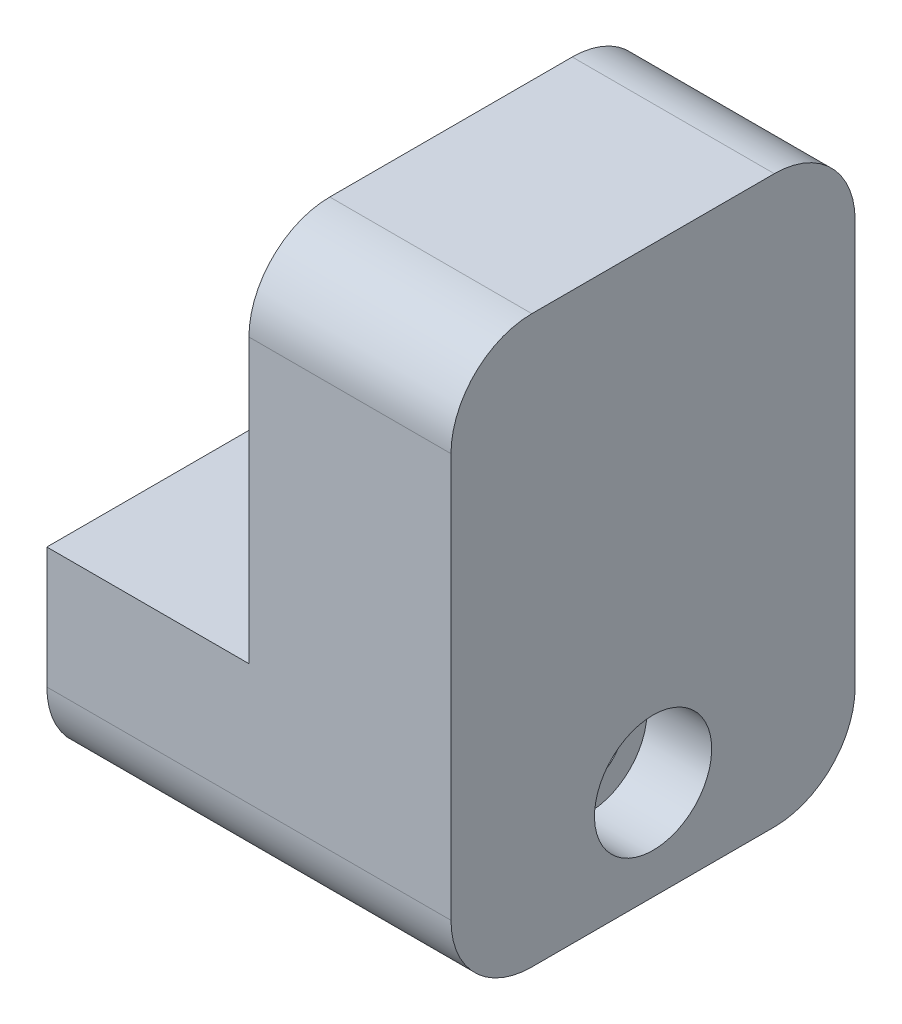
ISO-10303-21;
HEADER;
FILE_DESCRIPTION(('STEP AP214'),'2;1');
FILE_NAME('part.step','',(''),(''),'','','');
FILE_SCHEMA(('AUTOMOTIVE_DESIGN { 1 0 10303 214 1 1 1 1 }'));
ENDSEC;
DATA;
#1=APPLICATION_CONTEXT('core data for automotive mechanical design processes');
#2=APPLICATION_PROTOCOL_DEFINITION('international standard','automotive_design',2000,#1);
#3=PRODUCT_CONTEXT('',#1,'mechanical');
#4=PRODUCT('Part','Part','',(#3));
#5=PRODUCT_RELATED_PRODUCT_CATEGORY('part','',(#4));
#6=PRODUCT_DEFINITION_FORMATION('','',#4);
#7=PRODUCT_DEFINITION_CONTEXT('part definition',#1,'design');
#8=PRODUCT_DEFINITION('design','',#6,#7);
#9=PRODUCT_DEFINITION_SHAPE('','',#8);
#10=(LENGTH_UNIT() NAMED_UNIT(*) SI_UNIT(.MILLI.,.METRE.));
#11=(NAMED_UNIT(*) PLANE_ANGLE_UNIT() SI_UNIT($,.RADIAN.));
#12=(NAMED_UNIT(*) SI_UNIT($,.STERADIAN.) SOLID_ANGLE_UNIT());
#13=UNCERTAINTY_MEASURE_WITH_UNIT(LENGTH_MEASURE(1.E-05),#10,'distance_accuracy_value','');
#14=(GEOMETRIC_REPRESENTATION_CONTEXT(3) GLOBAL_UNCERTAINTY_ASSIGNED_CONTEXT((#13)) GLOBAL_UNIT_ASSIGNED_CONTEXT((#10,
#11,#12)) REPRESENTATION_CONTEXT('',''));
#15=CARTESIAN_POINT('',(0.,0.,0.));
#16=DIRECTION('',(0.,0.,1.));
#17=DIRECTION('',(1.,0.,0.));
#18=AXIS2_PLACEMENT_3D('',#15,#16,#17);
#19=CARTESIAN_POINT('',(6.35,-6.477,0.));
#20=DIRECTION('',(-1.,0.,0.));
#21=DIRECTION('',(0.,-1.,0.));
#22=AXIS2_PLACEMENT_3D('',#19,#20,#21);
#23=CYLINDRICAL_SURFACE('',#22,2.159);
#24=CARTESIAN_POINT('',(-19.05,-6.477,0.));
#25=DIRECTION('',(-1.,0.,0.));
#26=DIRECTION('',(0.,-1.,0.));
#27=AXIS2_PLACEMENT_3D('',#24,#25,#26);
#28=CIRCLE('',#27,2.159);
#29=CARTESIAN_POINT('',(-19.05,-8.636,0.));
#30=VERTEX_POINT('',#29);
#31=EDGE_CURVE('E127',#30,#30,#28,.T.);
#32=ORIENTED_EDGE('',*,*,#31,.T.);
#33=EDGE_LOOP('',(#32));
#34=FACE_BOUND('',#33,.T.);
#35=CARTESIAN_POINT('',(2.286,-6.47700000000001,0.));
#36=DIRECTION('',(1.,0.,0.));
#37=DIRECTION('',(0.,1.,0.));
#38=AXIS2_PLACEMENT_3D('',#35,#36,#37);
#39=CIRCLE('',#38,2.159);
#40=CARTESIAN_POINT('',(2.286,-4.318,0.));
#41=VERTEX_POINT('',#40);
#42=EDGE_CURVE('E515',#41,#41,#39,.T.);
#43=ORIENTED_EDGE('',*,*,#42,.T.);
#44=EDGE_LOOP('',(#43));
#45=FACE_BOUND('',#44,.T.);
#46=ADVANCED_FACE('F39',(#34,#45),#23,.F.);
#47=CARTESIAN_POINT('',(6.35,0.,12.7));
#48=DIRECTION('',(1.,0.,0.));
#49=DIRECTION('',(0.,1.,0.));
#50=AXIS2_PLACEMENT_3D('',#47,#48,#49);
#51=PLANE('',#50);
#52=CARTESIAN_POINT('',(6.35,-6.477,0.));
#53=DIRECTION('',(1.,0.,0.));
#54=DIRECTION('',(0.,1.,0.));
#55=AXIS2_PLACEMENT_3D('',#52,#53,#54);
#56=CIRCLE('',#55,3.683);
#57=CARTESIAN_POINT('',(6.35,-2.794,0.));
#58=VERTEX_POINT('',#57);
#59=EDGE_CURVE('E522',#58,#58,#56,.T.);
#60=ORIENTED_EDGE('',*,*,#59,.F.);
#61=EDGE_LOOP('',(#60));
#62=FACE_BOUND('',#61,.T.);
#63=DIRECTION('',(0.,-1.,0.));
#64=VECTOR('',#63,1.);
#65=CARTESIAN_POINT('',(6.35,0.,12.7));
#66=LINE('',#65,#64);
#67=CARTESIAN_POINT('',(6.34999999999999,17.78,12.7));
#68=VERTEX_POINT('',#67);
#69=CARTESIAN_POINT('',(6.35,-7.62,12.7));
#70=VERTEX_POINT('',#69);
#71=EDGE_CURVE('E150',#68,#70,#66,.T.);
#72=ORIENTED_EDGE('',*,*,#71,.T.);
#73=CARTESIAN_POINT('',(6.35,-7.62,7.62));
#74=DIRECTION('',(1.,0.,0.));
#75=DIRECTION('',(0.,1.,0.));
#76=AXIS2_PLACEMENT_3D('',#73,#74,#75);
#77=CIRCLE('',#76,5.08);
#78=CARTESIAN_POINT('',(6.35,-12.7,7.62));
#79=VERTEX_POINT('',#78);
#80=EDGE_CURVE('E180',#70,#79,#77,.T.);
#81=ORIENTED_EDGE('',*,*,#80,.T.);
#82=DIRECTION('',(0.,0.,-1.));
#83=VECTOR('',#82,1.);
#84=CARTESIAN_POINT('',(6.35,-12.7,12.7));
#85=LINE('',#84,#83);
#86=CARTESIAN_POINT('',(6.35,-12.7,-7.62));
#87=VERTEX_POINT('',#86);
#88=EDGE_CURVE('E155',#79,#87,#85,.T.);
#89=ORIENTED_EDGE('',*,*,#88,.T.);
#90=CARTESIAN_POINT('',(6.35,-7.62,-7.62));
#91=DIRECTION('',(1.,0.,0.));
#92=DIRECTION('',(0.,1.,0.));
#93=AXIS2_PLACEMENT_3D('',#90,#91,#92);
#94=CIRCLE('',#93,5.08);
#95=CARTESIAN_POINT('',(6.35,-7.62,-12.7));
#96=VERTEX_POINT('',#95);
#97=EDGE_CURVE('E178',#87,#96,#94,.T.);
#98=ORIENTED_EDGE('',*,*,#97,.T.);
#99=DIRECTION('',(0.,-1.,0.));
#100=VECTOR('',#99,1.);
#101=CARTESIAN_POINT('',(6.35,0.,-12.7));
#102=LINE('',#101,#100);
#103=CARTESIAN_POINT('',(6.34999999999999,17.78,-12.7));
#104=VERTEX_POINT('',#103);
#105=EDGE_CURVE('E149',#104,#96,#102,.T.);
#106=ORIENTED_EDGE('',*,*,#105,.F.);
#107=CARTESIAN_POINT('',(6.34999999999999,17.78,-7.62));
#108=DIRECTION('',(1.,0.,0.));
#109=DIRECTION('',(0.,1.,0.));
#110=AXIS2_PLACEMENT_3D('',#107,#108,#109);
#111=CIRCLE('',#110,5.08);
#112=CARTESIAN_POINT('',(6.34999999999999,22.86,-7.62));
#113=VERTEX_POINT('',#112);
#114=EDGE_CURVE('E176',#104,#113,#111,.T.);
#115=ORIENTED_EDGE('',*,*,#114,.T.);
#116=DIRECTION('',(0.,0.,-1.));
#117=VECTOR('',#116,1.);
#118=CARTESIAN_POINT('',(6.34999999999999,22.86,12.7));
#119=LINE('',#118,#117);
#120=CARTESIAN_POINT('',(6.34999999999999,22.86,7.62));
#121=VERTEX_POINT('',#120);
#122=EDGE_CURVE('E165',#121,#113,#119,.T.);
#123=ORIENTED_EDGE('',*,*,#122,.F.);
#124=CARTESIAN_POINT('',(6.34999999999999,17.78,7.62));
#125=DIRECTION('',(1.,0.,0.));
#126=DIRECTION('',(0.,1.,0.));
#127=AXIS2_PLACEMENT_3D('',#124,#125,#126);
#128=CIRCLE('',#127,5.08);
#129=EDGE_CURVE('E174',#121,#68,#128,.T.);
#130=ORIENTED_EDGE('',*,*,#129,.T.);
#131=EDGE_LOOP('',(#72,#81,#89,#98,#106,#115,#123,#130));
#132=FACE_BOUND('',#131,.T.);
#133=ADVANCED_FACE('F203',(#62,#132),#51,.T.);
#134=CARTESIAN_POINT('',(0.,22.86,12.7));
#135=DIRECTION('',(0.,1.,0.));
#136=DIRECTION('',(0.,0.,1.));
#137=AXIS2_PLACEMENT_3D('',#134,#135,#136);
#138=PLANE('',#137);
#139=ORIENTED_EDGE('',*,*,#122,.T.);
#140=DIRECTION('',(1.,0.,0.));
#141=VECTOR('',#140,1.);
#142=CARTESIAN_POINT('',(-6.35000000000001,22.86,-7.62));
#143=LINE('',#142,#141);
#144=CARTESIAN_POINT('',(-6.35000000000001,22.86,-7.62));
#145=VERTEX_POINT('',#144);
#146=EDGE_CURVE('E54',#113,#145,#143,.F.);
#147=ORIENTED_EDGE('',*,*,#146,.T.);
#148=DIRECTION('',(0.,0.,-1.));
#149=VECTOR('',#148,1.);
#150=CARTESIAN_POINT('',(-6.35000000000001,22.86,12.7));
#151=LINE('',#150,#149);
#152=CARTESIAN_POINT('',(-6.35000000000001,22.86,7.62));
#153=VERTEX_POINT('',#152);
#154=EDGE_CURVE('E163',#153,#145,#151,.T.);
#155=ORIENTED_EDGE('',*,*,#154,.F.);
#156=DIRECTION('',(1.,0.,0.));
#157=VECTOR('',#156,1.);
#158=CARTESIAN_POINT('',(0.,22.86,7.62));
#159=LINE('',#158,#157);
#160=EDGE_CURVE('E195',#153,#121,#159,.T.);
#161=ORIENTED_EDGE('',*,*,#160,.T.);
#162=EDGE_LOOP('',(#139,#147,#155,#161));
#163=FACE_BOUND('',#162,.T.);
#164=ADVANCED_FACE('F200',(#163),#138,.T.);
#165=CARTESIAN_POINT('',(-6.35,0.,12.7));
#166=DIRECTION('',(1.,0.,0.));
#167=DIRECTION('',(0.,1.,0.));
#168=AXIS2_PLACEMENT_3D('',#165,#166,#167);
#169=PLANE('',#168);
#170=CARTESIAN_POINT('',(-6.35,5.08,-10.16));
#171=DIRECTION('',(-1.,0.,0.));
#172=DIRECTION('',(0.,-1.,0.));
#173=AXIS2_PLACEMENT_3D('',#170,#171,#172);
#174=CIRCLE('',#173,1.143);
#175=CARTESIAN_POINT('',(-6.35,3.937,-10.16));
#176=VERTEX_POINT('',#175);
#177=EDGE_CURVE('E503',#176,#176,#174,.T.);
#178=ORIENTED_EDGE('',*,*,#177,.F.);
#179=EDGE_LOOP('',(#178));
#180=FACE_BOUND('',#179,.T.);
#181=CARTESIAN_POINT('',(-6.35,5.08,10.16));
#182=DIRECTION('',(-1.,0.,0.));
#183=DIRECTION('',(0.,-1.,0.));
#184=AXIS2_PLACEMENT_3D('',#181,#182,#183);
#185=CIRCLE('',#184,1.143);
#186=CARTESIAN_POINT('',(-6.35,3.93700000000001,10.16));
#187=VERTEX_POINT('',#186);
#188=EDGE_CURVE('E507',#187,#187,#185,.T.);
#189=ORIENTED_EDGE('',*,*,#188,.F.);
#190=EDGE_LOOP('',(#189));
#191=FACE_BOUND('',#190,.T.);
#192=CARTESIAN_POINT('',(-6.35000000000001,17.78,10.16));
#193=DIRECTION('',(-1.,0.,0.));
#194=DIRECTION('',(0.,-1.,0.));
#195=AXIS2_PLACEMENT_3D('',#192,#193,#194);
#196=CIRCLE('',#195,1.143);
#197=CARTESIAN_POINT('',(-6.35000000000001,16.637,10.16));
#198=VERTEX_POINT('',#197);
#199=EDGE_CURVE('E519',#198,#198,#196,.T.);
#200=ORIENTED_EDGE('',*,*,#199,.F.);
#201=EDGE_LOOP('',(#200));
#202=FACE_BOUND('',#201,.T.);
#203=CARTESIAN_POINT('',(-6.35000000000001,17.78,-10.16));
#204=DIRECTION('',(-1.,0.,0.));
#205=DIRECTION('',(0.,-1.,0.));
#206=AXIS2_PLACEMENT_3D('',#203,#204,#205);
#207=CIRCLE('',#206,1.143);
#208=CARTESIAN_POINT('',(-6.35000000000001,16.637,-10.16));
#209=VERTEX_POINT('',#208);
#210=EDGE_CURVE('E516',#209,#209,#207,.T.);
#211=ORIENTED_EDGE('',*,*,#210,.F.);
#212=EDGE_LOOP('',(#211));
#213=FACE_BOUND('',#212,.T.);
#214=ORIENTED_EDGE('',*,*,#154,.T.);
#215=CARTESIAN_POINT('',(-6.35000000000001,17.78,-7.62));
#216=DIRECTION('',(1.,0.,0.));
#217=DIRECTION('',(0.,1.,0.));
#218=AXIS2_PLACEMENT_3D('',#215,#216,#217);
#219=CIRCLE('',#218,5.08);
#220=CARTESIAN_POINT('',(-6.35000000000001,17.78,-12.7));
#221=VERTEX_POINT('',#220);
#222=EDGE_CURVE('E11',#145,#221,#219,.F.);
#223=ORIENTED_EDGE('',*,*,#222,.T.);
#224=DIRECTION('',(0.,-1.,0.));
#225=VECTOR('',#224,1.);
#226=CARTESIAN_POINT('',(-6.35,0.,-12.7));
#227=LINE('',#226,#225);
#228=CARTESIAN_POINT('',(-6.35,0.,-12.7));
#229=VERTEX_POINT('',#228);
#230=EDGE_CURVE('E153',#221,#229,#227,.T.);
#231=ORIENTED_EDGE('',*,*,#230,.T.);
#232=DIRECTION('',(0.,0.,-1.));
#233=VECTOR('',#232,1.);
#234=CARTESIAN_POINT('',(-6.35,0.,12.7));
#235=LINE('',#234,#233);
#236=CARTESIAN_POINT('',(-6.35,0.,12.7));
#237=VERTEX_POINT('',#236);
#238=EDGE_CURVE('E161',#237,#229,#235,.T.);
#239=ORIENTED_EDGE('',*,*,#238,.F.);
#240=DIRECTION('',(0.,-1.,0.));
#241=VECTOR('',#240,1.);
#242=CARTESIAN_POINT('',(-6.35,0.,12.7));
#243=LINE('',#242,#241);
#244=CARTESIAN_POINT('',(-6.35000000000001,17.78,12.7));
#245=VERTEX_POINT('',#244);
#246=EDGE_CURVE('E123',#245,#237,#243,.T.);
#247=ORIENTED_EDGE('',*,*,#246,.F.);
#248=CARTESIAN_POINT('',(-6.35000000000001,17.78,7.62));
#249=DIRECTION('',(1.,0.,0.));
#250=DIRECTION('',(0.,1.,0.));
#251=AXIS2_PLACEMENT_3D('',#248,#249,#250);
#252=CIRCLE('',#251,5.08);
#253=EDGE_CURVE('E47',#245,#153,#252,.F.);
#254=ORIENTED_EDGE('',*,*,#253,.T.);
#255=EDGE_LOOP('',(#214,#223,#231,#239,#247,#254));
#256=FACE_BOUND('',#255,.T.);
#257=ADVANCED_FACE('F214',(#180,#191,#202,#213,#256),#169,.F.);
#258=CARTESIAN_POINT('',(0.,-12.7,12.7));
#259=DIRECTION('',(0.,1.,0.));
#260=DIRECTION('',(-1.,0.,0.));
#261=AXIS2_PLACEMENT_3D('',#258,#259,#260);
#262=PLANE('',#261);
#263=ORIENTED_EDGE('',*,*,#88,.F.);
#264=DIRECTION('',(1.,0.,0.));
#265=VECTOR('',#264,1.);
#266=CARTESIAN_POINT('',(-19.05,-12.7,7.62));
#267=LINE('',#266,#265);
#268=CARTESIAN_POINT('',(-19.05,-12.7,7.62));
#269=VERTEX_POINT('',#268);
#270=EDGE_CURVE('E185',#79,#269,#267,.F.);
#271=ORIENTED_EDGE('',*,*,#270,.T.);
#272=DIRECTION('',(0.,0.,1.));
#273=VECTOR('',#272,1.);
#274=CARTESIAN_POINT('',(-19.05,-12.7,-35.5952505991963));
#275=LINE('',#274,#273);
#276=CARTESIAN_POINT('',(-19.05,-12.7,-7.62));
#277=VERTEX_POINT('',#276);
#278=EDGE_CURVE('E137',#277,#269,#275,.T.);
#279=ORIENTED_EDGE('',*,*,#278,.F.);
#280=DIRECTION('',(1.,0.,0.));
#281=VECTOR('',#280,1.);
#282=CARTESIAN_POINT('',(0.,-12.7,-7.62));
#283=LINE('',#282,#281);
#284=EDGE_CURVE('E182',#277,#87,#283,.T.);
#285=ORIENTED_EDGE('',*,*,#284,.T.);
#286=EDGE_LOOP('',(#263,#271,#279,#285));
#287=FACE_BOUND('',#286,.T.);
#288=ADVANCED_FACE('F220',(#287),#262,.F.);
#289=CARTESIAN_POINT('',(0.,0.,12.7));
#290=DIRECTION('',(0.,0.,1.));
#291=DIRECTION('',(1.,0.,0.));
#292=AXIS2_PLACEMENT_3D('',#289,#290,#291);
#293=PLANE('',#292);
#294=DIRECTION('',(0.,-1.,0.));
#295=VECTOR('',#294,1.);
#296=CARTESIAN_POINT('',(-19.05,0.,12.7));
#297=LINE('',#296,#295);
#298=CARTESIAN_POINT('',(-19.05,0.,12.7));
#299=VERTEX_POINT('',#298);
#300=CARTESIAN_POINT('',(-19.05,-7.61999999999999,12.7));
#301=VERTEX_POINT('',#300);
#302=EDGE_CURVE('E121',#299,#301,#297,.T.);
#303=ORIENTED_EDGE('',*,*,#302,.T.);
#304=DIRECTION('',(1.,0.,0.));
#305=VECTOR('',#304,1.);
#306=CARTESIAN_POINT('',(6.35,-7.62,12.7));
#307=LINE('',#306,#305);
#308=EDGE_CURVE('E172',#301,#70,#307,.T.);
#309=ORIENTED_EDGE('',*,*,#308,.T.);
#310=ORIENTED_EDGE('',*,*,#71,.F.);
#311=DIRECTION('',(1.,0.,0.));
#312=VECTOR('',#311,1.);
#313=CARTESIAN_POINT('',(0.,17.78,12.7));
#314=LINE('',#313,#312);
#315=EDGE_CURVE('E167',#68,#245,#314,.F.);
#316=ORIENTED_EDGE('',*,*,#315,.T.);
#317=ORIENTED_EDGE('',*,*,#246,.T.);
#318=DIRECTION('',(-1.,0.,0.));
#319=VECTOR('',#318,1.);
#320=CARTESIAN_POINT('',(0.,0.,12.7));
#321=LINE('',#320,#319);
#322=EDGE_CURVE('E116',#237,#299,#321,.T.);
#323=ORIENTED_EDGE('',*,*,#322,.T.);
#324=EDGE_LOOP('',(#303,#309,#310,#316,#317,#323));
#325=FACE_BOUND('',#324,.T.);
#326=ADVANCED_FACE('F118',(#325),#293,.T.);
#327=CARTESIAN_POINT('',(0.,0.,-12.7));
#328=DIRECTION('',(0.,0.,1.));
#329=DIRECTION('',(1.,0.,0.));
#330=AXIS2_PLACEMENT_3D('',#327,#328,#329);
#331=PLANE('',#330);
#332=ORIENTED_EDGE('',*,*,#105,.T.);
#333=DIRECTION('',(1.,0.,0.));
#334=VECTOR('',#333,1.);
#335=CARTESIAN_POINT('',(0.,-7.62,-12.7));
#336=LINE('',#335,#334);
#337=CARTESIAN_POINT('',(-19.05,-7.61999999999999,-12.7));
#338=VERTEX_POINT('',#337);
#339=EDGE_CURVE('E193',#96,#338,#336,.F.);
#340=ORIENTED_EDGE('',*,*,#339,.T.);
#341=DIRECTION('',(0.,1.,0.));
#342=VECTOR('',#341,1.);
#343=CARTESIAN_POINT('',(-19.05,0.,-12.7));
#344=LINE('',#343,#342);
#345=CARTESIAN_POINT('',(-19.05,0.,-12.7));
#346=VERTEX_POINT('',#345);
#347=EDGE_CURVE('E146',#338,#346,#344,.T.);
#348=ORIENTED_EDGE('',*,*,#347,.T.);
#349=DIRECTION('',(1.,0.,0.));
#350=VECTOR('',#349,1.);
#351=CARTESIAN_POINT('',(0.,0.,-12.7));
#352=LINE('',#351,#350);
#353=EDGE_CURVE('E134',#346,#229,#352,.T.);
#354=ORIENTED_EDGE('',*,*,#353,.T.);
#355=ORIENTED_EDGE('',*,*,#230,.F.);
#356=DIRECTION('',(1.,0.,0.));
#357=VECTOR('',#356,1.);
#358=CARTESIAN_POINT('',(6.34999999999999,17.78,-12.7));
#359=LINE('',#358,#357);
#360=EDGE_CURVE('E190',#221,#104,#359,.T.);
#361=ORIENTED_EDGE('',*,*,#360,.T.);
#362=EDGE_LOOP('',(#332,#340,#348,#354,#355,#361));
#363=FACE_BOUND('',#362,.T.);
#364=ADVANCED_FACE('F212',(#363),#331,.F.);
#365=CARTESIAN_POINT('',(0.,0.,-35.5952505991963));
#366=DIRECTION('',(0.,1.,0.));
#367=DIRECTION('',(-1.,0.,0.));
#368=AXIS2_PLACEMENT_3D('',#365,#366,#367);
#369=PLANE('',#368);
#370=ORIENTED_EDGE('',*,*,#238,.T.);
#371=ORIENTED_EDGE('',*,*,#353,.F.);
#372=DIRECTION('',(0.,0.,1.));
#373=VECTOR('',#372,1.);
#374=CARTESIAN_POINT('',(-19.05,0.,-35.5952505991963));
#375=LINE('',#374,#373);
#376=EDGE_CURVE('E131',#346,#299,#375,.T.);
#377=ORIENTED_EDGE('',*,*,#376,.T.);
#378=ORIENTED_EDGE('',*,*,#322,.F.);
#379=EDGE_LOOP('',(#370,#371,#377,#378));
#380=FACE_BOUND('',#379,.T.);
#381=ADVANCED_FACE('F132',(#380),#369,.T.);
#382=CARTESIAN_POINT('',(-19.05,0.,-35.5952505991963));
#383=DIRECTION('',(-1.,0.,0.));
#384=DIRECTION('',(0.,-1.,0.));
#385=AXIS2_PLACEMENT_3D('',#382,#383,#384);
#386=PLANE('',#385);
#387=ORIENTED_EDGE('',*,*,#31,.F.);
#388=EDGE_LOOP('',(#387));
#389=FACE_BOUND('',#388,.T.);
#390=ORIENTED_EDGE('',*,*,#278,.T.);
#391=CARTESIAN_POINT('',(-19.05,-7.61999999999999,7.62));
#392=DIRECTION('',(-1.,0.,0.));
#393=DIRECTION('',(0.,-1.,0.));
#394=AXIS2_PLACEMENT_3D('',#391,#392,#393);
#395=CIRCLE('',#394,5.08);
#396=EDGE_CURVE('E142',#269,#301,#395,.T.);
#397=ORIENTED_EDGE('',*,*,#396,.T.);
#398=ORIENTED_EDGE('',*,*,#302,.F.);
#399=ORIENTED_EDGE('',*,*,#376,.F.);
#400=ORIENTED_EDGE('',*,*,#347,.F.);
#401=CARTESIAN_POINT('',(-19.05,-7.61999999999999,-7.62));
#402=DIRECTION('',(-1.,0.,0.));
#403=DIRECTION('',(0.,-1.,0.));
#404=AXIS2_PLACEMENT_3D('',#401,#402,#403);
#405=CIRCLE('',#404,5.08);
#406=EDGE_CURVE('E187',#338,#277,#405,.T.);
#407=ORIENTED_EDGE('',*,*,#406,.T.);
#408=EDGE_LOOP('',(#390,#397,#398,#399,#400,#407));
#409=FACE_BOUND('',#408,.T.);
#410=ADVANCED_FACE('F140',(#389,#409),#386,.T.);
#411=CARTESIAN_POINT('',(2.286,-6.47700000000001,0.));
#412=DIRECTION('',(1.,0.,0.));
#413=DIRECTION('',(0.,1.,0.));
#414=AXIS2_PLACEMENT_3D('',#411,#412,#413);
#415=CYLINDRICAL_SURFACE('',#414,3.683);
#416=CARTESIAN_POINT('',(2.286,-6.47700000000001,0.));
#417=DIRECTION('',(1.,0.,0.));
#418=DIRECTION('',(0.,1.,0.));
#419=AXIS2_PLACEMENT_3D('',#416,#417,#418);
#420=CIRCLE('',#419,3.683);
#421=CARTESIAN_POINT('',(2.286,-2.794,0.));
#422=VERTEX_POINT('',#421);
#423=EDGE_CURVE('E170',#422,#422,#420,.T.);
#424=ORIENTED_EDGE('',*,*,#423,.F.);
#425=EDGE_LOOP('',(#424));
#426=FACE_BOUND('',#425,.T.);
#427=ORIENTED_EDGE('',*,*,#59,.T.);
#428=EDGE_LOOP('',(#427));
#429=FACE_BOUND('',#428,.T.);
#430=ADVANCED_FACE('F248',(#426,#429),#415,.F.);
#431=CARTESIAN_POINT('',(2.286,-6.47700000000001,0.));
#432=DIRECTION('',(1.,0.,0.));
#433=DIRECTION('',(0.,1.,0.));
#434=AXIS2_PLACEMENT_3D('',#431,#432,#433);
#435=PLANE('',#434);
#436=ORIENTED_EDGE('',*,*,#42,.F.);
#437=EDGE_LOOP('',(#436));
#438=FACE_BOUND('',#437,.T.);
#439=ORIENTED_EDGE('',*,*,#423,.T.);
#440=EDGE_LOOP('',(#439));
#441=FACE_BOUND('',#440,.T.);
#442=ADVANCED_FACE('F299',(#438,#441),#435,.T.);
#443=CARTESIAN_POINT('',(1.26999999999999,17.78,-10.16));
#444=DIRECTION('',(-1.,0.,0.));
#445=DIRECTION('',(0.,-1.,0.));
#446=AXIS2_PLACEMENT_3D('',#443,#444,#445);
#447=CYLINDRICAL_SURFACE('',#446,1.143);
#448=CARTESIAN_POINT('',(1.26999999999999,17.78,-10.16));
#449=DIRECTION('',(-1.,0.,0.));
#450=DIRECTION('',(0.,-1.,0.));
#451=AXIS2_PLACEMENT_3D('',#448,#449,#450);
#452=CIRCLE('',#451,1.143);
#453=CARTESIAN_POINT('',(1.26999999999999,16.637,-10.16));
#454=VERTEX_POINT('',#453);
#455=EDGE_CURVE('E512',#454,#454,#452,.T.);
#456=ORIENTED_EDGE('',*,*,#455,.F.);
#457=EDGE_LOOP('',(#456));
#458=FACE_BOUND('',#457,.T.);
#459=ORIENTED_EDGE('',*,*,#210,.T.);
#460=EDGE_LOOP('',(#459));
#461=FACE_BOUND('',#460,.T.);
#462=ADVANCED_FACE('F306',(#458,#461),#447,.F.);
#463=CARTESIAN_POINT('',(1.26999999999999,17.78,-10.16));
#464=DIRECTION('',(-1.,0.,0.));
#465=DIRECTION('',(0.,-1.,0.));
#466=AXIS2_PLACEMENT_3D('',#463,#464,#465);
#467=PLANE('',#466);
#468=ORIENTED_EDGE('',*,*,#455,.T.);
#469=EDGE_LOOP('',(#468));
#470=FACE_BOUND('',#469,.T.);
#471=ADVANCED_FACE('F313',(#470),#467,.T.);
#472=CARTESIAN_POINT('',(1.26999999999999,17.78,10.16));
#473=DIRECTION('',(-1.,0.,0.));
#474=DIRECTION('',(0.,-1.,0.));
#475=AXIS2_PLACEMENT_3D('',#472,#473,#474);
#476=CYLINDRICAL_SURFACE('',#475,1.143);
#477=CARTESIAN_POINT('',(1.26999999999999,17.78,10.16));
#478=DIRECTION('',(-1.,0.,0.));
#479=DIRECTION('',(0.,-1.,0.));
#480=AXIS2_PLACEMENT_3D('',#477,#478,#479);
#481=CIRCLE('',#480,1.143);
#482=CARTESIAN_POINT('',(1.26999999999999,16.637,10.16));
#483=VERTEX_POINT('',#482);
#484=EDGE_CURVE('E535',#483,#483,#481,.T.);
#485=ORIENTED_EDGE('',*,*,#484,.F.);
#486=EDGE_LOOP('',(#485));
#487=FACE_BOUND('',#486,.T.);
#488=ORIENTED_EDGE('',*,*,#199,.T.);
#489=EDGE_LOOP('',(#488));
#490=FACE_BOUND('',#489,.T.);
#491=ADVANCED_FACE('F321',(#487,#490),#476,.F.);
#492=CARTESIAN_POINT('',(1.26999999999999,17.78,10.16));
#493=DIRECTION('',(-1.,0.,0.));
#494=DIRECTION('',(0.,-1.,0.));
#495=AXIS2_PLACEMENT_3D('',#492,#493,#494);
#496=PLANE('',#495);
#497=ORIENTED_EDGE('',*,*,#484,.T.);
#498=EDGE_LOOP('',(#497));
#499=FACE_BOUND('',#498,.T.);
#500=ADVANCED_FACE('F329',(#499),#496,.T.);
#501=CARTESIAN_POINT('',(1.27,5.08000000000001,10.16));
#502=DIRECTION('',(-1.,0.,0.));
#503=DIRECTION('',(0.,-1.,0.));
#504=AXIS2_PLACEMENT_3D('',#501,#502,#503);
#505=CYLINDRICAL_SURFACE('',#504,1.143);
#506=CARTESIAN_POINT('',(1.27,5.08000000000001,10.16));
#507=DIRECTION('',(-1.,0.,0.));
#508=DIRECTION('',(0.,-1.,0.));
#509=AXIS2_PLACEMENT_3D('',#506,#507,#508);
#510=CIRCLE('',#509,1.143);
#511=CARTESIAN_POINT('',(1.27,3.93700000000001,10.16));
#512=VERTEX_POINT('',#511);
#513=EDGE_CURVE('E504',#512,#512,#510,.T.);
#514=ORIENTED_EDGE('',*,*,#513,.F.);
#515=EDGE_LOOP('',(#514));
#516=FACE_BOUND('',#515,.T.);
#517=ORIENTED_EDGE('',*,*,#188,.T.);
#518=EDGE_LOOP('',(#517));
#519=FACE_BOUND('',#518,.T.);
#520=ADVANCED_FACE('F337',(#516,#519),#505,.F.);
#521=CARTESIAN_POINT('',(1.27,5.08000000000001,10.16));
#522=DIRECTION('',(-1.,0.,0.));
#523=DIRECTION('',(0.,-1.,0.));
#524=AXIS2_PLACEMENT_3D('',#521,#522,#523);
#525=PLANE('',#524);
#526=ORIENTED_EDGE('',*,*,#513,.T.);
#527=EDGE_LOOP('',(#526));
#528=FACE_BOUND('',#527,.T.);
#529=ADVANCED_FACE('F345',(#528),#525,.T.);
#530=CARTESIAN_POINT('',(1.27,5.08,-10.16));
#531=DIRECTION('',(-1.,0.,0.));
#532=DIRECTION('',(0.,-1.,0.));
#533=AXIS2_PLACEMENT_3D('',#530,#531,#532);
#534=CYLINDRICAL_SURFACE('',#533,1.143);
#535=CARTESIAN_POINT('',(1.27,5.08,-10.16));
#536=DIRECTION('',(-1.,0.,0.));
#537=DIRECTION('',(0.,-1.,0.));
#538=AXIS2_PLACEMENT_3D('',#535,#536,#537);
#539=CIRCLE('',#538,1.143);
#540=CARTESIAN_POINT('',(1.27,3.937,-10.16));
#541=VERTEX_POINT('',#540);
#542=EDGE_CURVE('E500',#541,#541,#539,.T.);
#543=ORIENTED_EDGE('',*,*,#542,.F.);
#544=EDGE_LOOP('',(#543));
#545=FACE_BOUND('',#544,.T.);
#546=ORIENTED_EDGE('',*,*,#177,.T.);
#547=EDGE_LOOP('',(#546));
#548=FACE_BOUND('',#547,.T.);
#549=ADVANCED_FACE('F234',(#545,#548),#534,.F.);
#550=CARTESIAN_POINT('',(1.27,5.08,-10.16));
#551=DIRECTION('',(-1.,0.,0.));
#552=DIRECTION('',(0.,-1.,0.));
#553=AXIS2_PLACEMENT_3D('',#550,#551,#552);
#554=PLANE('',#553);
#555=ORIENTED_EDGE('',*,*,#542,.T.);
#556=EDGE_LOOP('',(#555));
#557=FACE_BOUND('',#556,.T.);
#558=ADVANCED_FACE('F226',(#557),#554,.T.);
#559=CARTESIAN_POINT('',(0.,-7.62,7.62));
#560=DIRECTION('',(-1.,0.,0.));
#561=DIRECTION('',(0.,-1.,0.));
#562=AXIS2_PLACEMENT_3D('',#559,#560,#561);
#563=CYLINDRICAL_SURFACE('',#562,5.08);
#564=ORIENTED_EDGE('',*,*,#396,.F.);
#565=ORIENTED_EDGE('',*,*,#270,.F.);
#566=ORIENTED_EDGE('',*,*,#80,.F.);
#567=ORIENTED_EDGE('',*,*,#308,.F.);
#568=EDGE_LOOP('',(#564,#565,#566,#567));
#569=FACE_BOUND('',#568,.T.);
#570=ADVANCED_FACE('F223',(#569),#563,.T.);
#571=CARTESIAN_POINT('',(0.,-7.62,-7.62));
#572=DIRECTION('',(1.,0.,0.));
#573=DIRECTION('',(0.,1.,0.));
#574=AXIS2_PLACEMENT_3D('',#571,#572,#573);
#575=CYLINDRICAL_SURFACE('',#574,5.08);
#576=ORIENTED_EDGE('',*,*,#406,.F.);
#577=ORIENTED_EDGE('',*,*,#339,.F.);
#578=ORIENTED_EDGE('',*,*,#97,.F.);
#579=ORIENTED_EDGE('',*,*,#284,.F.);
#580=EDGE_LOOP('',(#576,#577,#578,#579));
#581=FACE_BOUND('',#580,.T.);
#582=ADVANCED_FACE('F225',(#581),#575,.T.);
#583=CARTESIAN_POINT('',(0.,17.78,-7.62));
#584=DIRECTION('',(-1.,0.,0.));
#585=DIRECTION('',(0.,0.,1.));
#586=AXIS2_PLACEMENT_3D('',#583,#584,#585);
#587=CYLINDRICAL_SURFACE('',#586,5.08);
#588=ORIENTED_EDGE('',*,*,#222,.F.);
#589=ORIENTED_EDGE('',*,*,#146,.F.);
#590=ORIENTED_EDGE('',*,*,#114,.F.);
#591=ORIENTED_EDGE('',*,*,#360,.F.);
#592=EDGE_LOOP('',(#588,#589,#590,#591));
#593=FACE_BOUND('',#592,.T.);
#594=ADVANCED_FACE('F209',(#593),#587,.T.);
#595=CARTESIAN_POINT('',(0.,17.78,7.62));
#596=DIRECTION('',(1.,0.,0.));
#597=DIRECTION('',(0.,0.,-1.));
#598=AXIS2_PLACEMENT_3D('',#595,#596,#597);
#599=CYLINDRICAL_SURFACE('',#598,5.08);
#600=ORIENTED_EDGE('',*,*,#253,.F.);
#601=ORIENTED_EDGE('',*,*,#315,.F.);
#602=ORIENTED_EDGE('',*,*,#129,.F.);
#603=ORIENTED_EDGE('',*,*,#160,.F.);
#604=EDGE_LOOP('',(#600,#601,#602,#603));
#605=FACE_BOUND('',#604,.T.);
#606=ADVANCED_FACE('F41',(#605),#599,.T.);
#607=CLOSED_SHELL('',(#46,#133,#164,#257,#288,#326,#364,#381,#410,#430,#442,#462,#471,#491,#500,
#520,#529,#549,#558,#570,#582,#594,#606));
#608=MANIFOLD_SOLID_BREP('B2',#607);
#609=ADVANCED_BREP_SHAPE_REPRESENTATION('',(#18,#608),#14);
#610=SHAPE_DEFINITION_REPRESENTATION(#9,#609);
ENDSEC;
END-ISO-10303-21;
